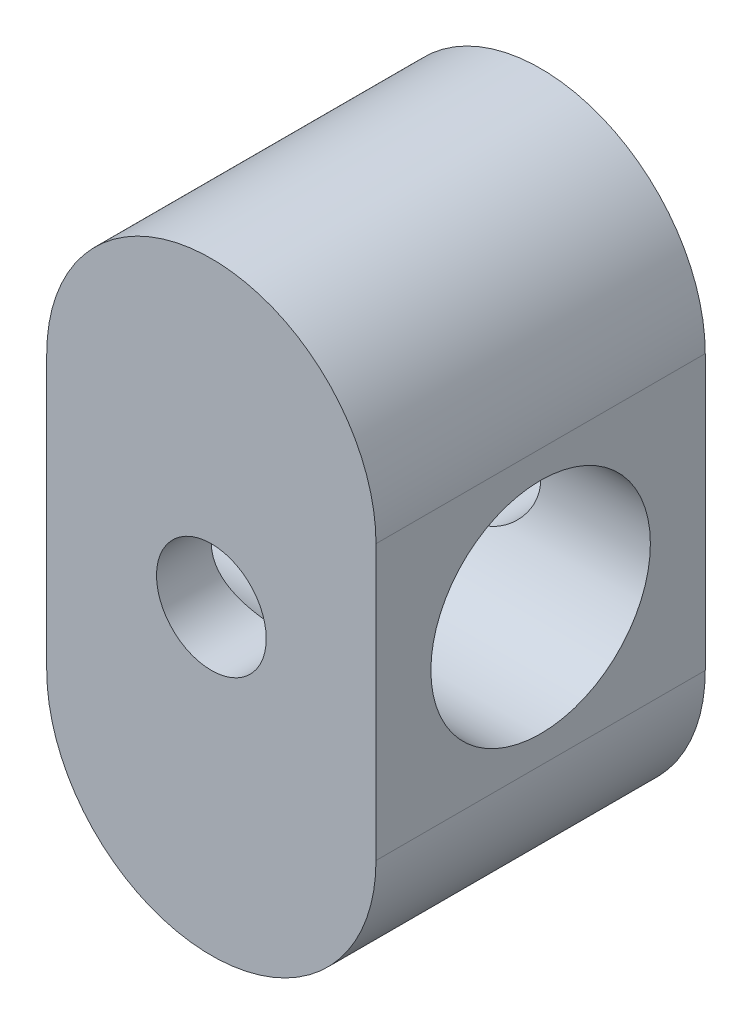
ISO-10303-21;
HEADER;
FILE_DESCRIPTION(('STEP AP214'),'2;1');
FILE_NAME('part.step','',(''),(''),'','','');
FILE_SCHEMA(('AUTOMOTIVE_DESIGN { 1 0 10303 214 1 1 1 1 }'));
ENDSEC;
DATA;
#1=APPLICATION_CONTEXT('core data for automotive mechanical design processes');
#2=APPLICATION_PROTOCOL_DEFINITION('international standard','automotive_design',2000,#1);
#3=PRODUCT_CONTEXT('',#1,'mechanical');
#4=PRODUCT('Part','Part','',(#3));
#5=PRODUCT_RELATED_PRODUCT_CATEGORY('part','',(#4));
#6=PRODUCT_DEFINITION_FORMATION('','',#4);
#7=PRODUCT_DEFINITION_CONTEXT('part definition',#1,'design');
#8=PRODUCT_DEFINITION('design','',#6,#7);
#9=PRODUCT_DEFINITION_SHAPE('','',#8);
#10=(LENGTH_UNIT() NAMED_UNIT(*) SI_UNIT(.MILLI.,.METRE.));
#11=(NAMED_UNIT(*) PLANE_ANGLE_UNIT() SI_UNIT($,.RADIAN.));
#12=(NAMED_UNIT(*) SI_UNIT($,.STERADIAN.) SOLID_ANGLE_UNIT());
#13=UNCERTAINTY_MEASURE_WITH_UNIT(LENGTH_MEASURE(1.E-05),#10,'distance_accuracy_value','');
#14=(GEOMETRIC_REPRESENTATION_CONTEXT(3) GLOBAL_UNCERTAINTY_ASSIGNED_CONTEXT((#13)) GLOBAL_UNIT_ASSIGNED_CONTEXT((#10,
#11,#12)) REPRESENTATION_CONTEXT('',''));
#15=CARTESIAN_POINT('',(0.,0.,0.));
#16=DIRECTION('',(0.,0.,1.));
#17=DIRECTION('',(1.,0.,0.));
#18=AXIS2_PLACEMENT_3D('',#15,#16,#17);
#19=CARTESIAN_POINT('',(0.,0.,38.1));
#20=DIRECTION('',(0.,0.,-1.));
#21=DIRECTION('',(-1.,0.,0.));
#22=AXIS2_PLACEMENT_3D('',#19,#20,#21);
#23=CYLINDRICAL_SURFACE('',#22,6.35);
#24=CARTESIAN_POINT('',(-6.35,0.,31.75));
#25=CARTESIAN_POINT('',(-6.34999944217588,-0.166990879194905,31.7499994891774));
#26=CARTESIAN_POINT('',(-6.34340517119929,-0.333993450198623,31.7466986728259));
#27=CARTESIAN_POINT('',(-6.31710332866815,-0.666768526640036,31.7335786203218));
#28=CARTESIAN_POINT('',(-6.29739005240762,-0.832540465223121,31.7237565484519));
#29=CARTESIAN_POINT('',(-6.24504620131107,-1.16177467728403,31.6978292478083));
#30=CARTESIAN_POINT('',(-6.21239720481971,-1.32523331106834,31.6817150589571));
#31=CARTESIAN_POINT('',(-6.13454367002308,-1.64849348247788,31.6436085062318));
#32=CARTESIAN_POINT('',(-6.0893339997623,-1.80829349634146,31.6216137398496));
#33=CARTESIAN_POINT('',(-5.98706118032938,-2.12244180878877,31.5723959142721));
#34=CARTESIAN_POINT('',(-5.93005033794381,-2.27681076158406,31.5451959650805));
#35=CARTESIAN_POINT('',(-5.80460027805888,-2.57993454237572,31.486150269919));
#36=CARTESIAN_POINT('',(-5.73615677992335,-2.728687241851,31.4543027843762));
#37=CARTESIAN_POINT('',(-5.51459167351378,-3.16512812193645,31.352881193969));
#38=CARTESIAN_POINT('',(-5.34512164103921,-3.44334503957524,31.2773713354024));
#39=CARTESIAN_POINT('',(-4.95605749398617,-3.98471796121714,31.1122186773861));
#40=CARTESIAN_POINT('',(-4.73405124179346,-4.24594454614361,31.0219972312188));
#41=CARTESIAN_POINT('',(-4.25114819119642,-4.72936553155195,30.8393960148839));
#42=CARTESIAN_POINT('',(-3.9902220337443,-4.95153018780438,30.7470146601478));
#43=CARTESIAN_POINT('',(-3.5628248667093,-5.25955398778229,30.6103243398217));
#44=CARTESIAN_POINT('',(-3.40820389376142,-5.3610627049131,30.5634721485475));
#45=CARTESIAN_POINT('',(-3.08994761547517,-5.55058368760464,30.4733099497228));
#46=CARTESIAN_POINT('',(-2.92631610947028,-5.63860158329208,30.4299984680683));
#47=CARTESIAN_POINT('',(-2.59094786440525,-5.800358082891,30.3484098057888));
#48=CARTESIAN_POINT('',(-2.41921165860542,-5.87409762464253,30.3101322945723));
#49=CARTESIAN_POINT('',(-2.06881694320015,-6.00645788836519,30.2400882100936));
#50=CARTESIAN_POINT('',(-1.89016259620782,-6.06508754416237,30.2083177917589));
#51=CARTESIAN_POINT('',(-1.53802379102959,-6.16347180761614,30.154259497995));
#52=CARTESIAN_POINT('',(-1.36486498251088,-6.20414249112447,30.13151961136));
#53=CARTESIAN_POINT('',(-1.0149100900955,-6.27089941680448,30.0938804844397));
#54=CARTESIAN_POINT('',(-0.83811416212465,-6.29698628284913,30.0789809087597));
#55=CARTESIAN_POINT('',(-0.48259070523578,-6.33415533919377,30.0576763086804));
#56=CARTESIAN_POINT('',(-0.303864939404368,-6.34525022098376,30.0512640993806));
#57=CARTESIAN_POINT('',(0.0539765423064514,-6.35229110757549,30.0472004886715));
#58=CARTESIAN_POINT('',(0.233092219351493,-6.34823855771194,30.0495482514047));
#59=CARTESIAN_POINT('',(0.568582301875067,-6.32645177136462,30.062090292946));
#60=CARTESIAN_POINT('',(0.72510735987022,-6.31041699475488,30.0713095833287));
#61=CARTESIAN_POINT('',(1.03609053465783,-6.2668713449148,30.096128374712));
#62=CARTESIAN_POINT('',(1.19054795272157,-6.23935668847137,30.1117299789813));
#63=CARTESIAN_POINT('',(1.49631129670201,-6.17316873448519,30.1488027904553));
#64=CARTESIAN_POINT('',(1.64761763355948,-6.13449690187387,30.170273227066));
#65=CARTESIAN_POINT('',(1.94623864200335,-6.04639785576762,30.2184190383084));
#66=CARTESIAN_POINT('',(2.09355171924189,-5.99696641549927,30.2450964580098));
#67=CARTESIAN_POINT('',(2.53492872693472,-5.83067999912412,30.3331376118079));
#68=CARTESIAN_POINT('',(2.82155056219387,-5.69733157989735,30.401625656313));
#69=CARTESIAN_POINT('',(3.36957685011721,-5.39139880582654,30.550071400071));
#70=CARTESIAN_POINT('',(3.63096990042998,-5.21879682720649,30.6300342452273));
#71=CARTESIAN_POINT('',(4.15618743095877,-4.81373716307424,30.8046812882033));
#72=CARTESIAN_POINT('',(4.41611767035084,-4.57646495884523,30.8999465086129));
#73=CARTESIAN_POINT('',(4.89420340086183,-4.0611227505291,31.0862854764244));
#74=CARTESIAN_POINT('',(5.11233892714115,-3.78303336001455,31.1773572049436));
#75=CARTESIAN_POINT('',(5.40822137451721,-3.33286643739697,31.305938857257));
#76=CARTESIAN_POINT('',(5.50335984672242,-3.17335722609791,31.3483050254296));
#77=CARTESIAN_POINT('',(5.67970671124367,-2.84569771626438,31.4282218301755));
#78=CARTESIAN_POINT('',(5.76092136612927,-2.67755134695862,31.4657746297482));
#79=CARTESIAN_POINT('',(5.90854657110693,-2.33378760343931,31.534957929256));
#80=CARTESIAN_POINT('',(5.97496287286554,-2.15817316355138,31.5665907293456));
#81=CARTESIAN_POINT('',(6.09222165998248,-1.80074808519267,31.6229876360055));
#82=CARTESIAN_POINT('',(6.14306593691524,-1.61893816219401,31.6477525327026));
#83=CARTESIAN_POINT('',(6.22494695974544,-1.26593635485428,31.6878915597613));
#84=CARTESIAN_POINT('',(6.25727558630872,-1.09511243698786,31.7038736459652));
#85=CARTESIAN_POINT('',(6.30784558836316,-0.750891318848436,31.7289562420375));
#86=CARTESIAN_POINT('',(6.32608773009978,-0.577494259066548,31.7380571262137));
#87=CARTESIAN_POINT('',(6.34823872389932,-0.229629611373417,31.7491158370576));
#88=CARTESIAN_POINT('',(6.35215330679286,-0.0551624794535625,31.7510765197081));
#89=CARTESIAN_POINT('',(6.34561139205059,0.293430507417573,31.7478059034872));
#90=CARTESIAN_POINT('',(6.33515553041994,0.467556377130841,31.7425749229034));
#91=CARTESIAN_POINT('',(6.30138636847944,0.800509536744078,31.7257555094506));
#92=CARTESIAN_POINT('',(6.27913692599813,0.959472887164153,31.7146934781011));
#93=CARTESIAN_POINT('',(6.22277883751831,1.2748284005213,31.6868459564446));
#94=CARTESIAN_POINT('',(6.1886661654175,1.43121967166,31.6700585231077));
#95=CARTESIAN_POINT('',(6.10895204704105,1.7403077686404,31.631159973299));
#96=CARTESIAN_POINT('',(6.06335428272778,1.89300576133386,31.6090505630802));
#97=CARTESIAN_POINT('',(5.96108560894157,2.19390570072535,31.5599971792976));
#98=CARTESIAN_POINT('',(5.90441038996764,2.34210587161404,31.5330513245292));
#99=CARTESIAN_POINT('',(5.77873770602808,2.63725856238891,31.4740951779885));
#100=CARTESIAN_POINT('',(5.70943799490311,2.78405822350622,31.4419635638501));
#101=CARTESIAN_POINT('',(5.56021860592232,3.07126756713196,31.37392525103));
#102=CARTESIAN_POINT('',(5.48029532806431,3.21167506178123,31.3380172735192));
#103=CARTESIAN_POINT('',(5.22545088631857,3.62227376445689,31.2257741292216));
#104=CARTESIAN_POINT('',(5.03538892121195,3.8819954012841,31.1448877082824));
#105=CARTESIAN_POINT('',(4.59886015583266,4.39279994151146,30.9694499483036));
#106=CARTESIAN_POINT('',(4.34868719486685,4.64052990372701,30.8743367236915));
#107=CARTESIAN_POINT('',(3.94508991014853,4.9789239543965,30.7339772811164));
#108=CARTESIAN_POINT('',(3.80572389485982,5.08625380253176,30.6875432562751));
#109=CARTESIAN_POINT('',(3.51806625732098,5.28929908879009,30.5966734049483));
#110=CARTESIAN_POINT('',(3.3697733046221,5.38501278922795,30.5522378780468));
#111=CARTESIAN_POINT('',(3.05757189938893,5.56849389071525,30.4645838039713));
#112=CARTESIAN_POINT('',(2.89325455594918,5.65564549590477,30.4215304916549));
#113=CARTESIAN_POINT('',(2.55662946610005,5.81556909376682,30.340579644901));
#114=CARTESIAN_POINT('',(2.38432562101098,5.88834801781484,30.3026796279935));
#115=CARTESIAN_POINT('',(2.03292083584069,6.01870593214496,30.2334979926119));
#116=CARTESIAN_POINT('',(1.85382548494069,6.07629712370975,30.2022110654534));
#117=CARTESIAN_POINT('',(1.49010166197982,6.1755660505623,30.1475495796607));
#118=CARTESIAN_POINT('',(1.30547405141578,6.21724624980147,30.1241737959829));
#119=CARTESIAN_POINT('',(0.950261741474653,6.28083303239845,30.088221566145));
#120=CARTESIAN_POINT('',(0.780030300815074,6.30425367574493,30.0748238589961));
#121=CARTESIAN_POINT('',(0.437794026308638,6.33722186745438,30.0559068618669));
#122=CARTESIAN_POINT('',(0.265789313868249,6.34677035930015,30.0503870360907));
#123=CARTESIAN_POINT('',(-0.0784312834340542,6.3518475564986,30.0474561088362));
#124=CARTESIAN_POINT('',(-0.250647066626202,6.34738144738998,30.0500420081603));
#125=CARTESIAN_POINT('',(-0.5938336660463,6.32451076696088,30.0632073594892));
#126=CARTESIAN_POINT('',(-0.764804532951271,6.30610676625141,30.073786484255));
#127=CARTESIAN_POINT('',(-1.08782968989589,6.25804920718463,30.1011312712702));
#128=CARTESIAN_POINT('',(-1.24012931802116,6.22963986719982,30.1172085028909));
#129=CARTESIAN_POINT('',(-1.54160036066761,6.16196939123337,30.1550268373618));
#130=CARTESIAN_POINT('',(-1.69077071883265,6.12270465222519,30.1767698205995));
#131=CARTESIAN_POINT('',(-2.13222433158772,5.98919755549728,30.2495485940621));
#132=CARTESIAN_POINT('',(-2.41865701909235,5.87921095671373,30.3081531108883));
#133=CARTESIAN_POINT('',(-2.98851600553177,5.61221709335548,30.4437155944897));
#134=CARTESIAN_POINT('',(-3.27044739745236,5.4525471930957,30.5216421113511));
#135=CARTESIAN_POINT('',(-3.80537307337073,5.09367320950779,30.685439817654));
#136=CARTESIAN_POINT('',(-4.05835219423339,4.89444855823949,30.7713151279082));
#137=CARTESIAN_POINT('',(-4.5602382551382,4.43354035272873,30.9538699110716));
#138=CARTESIAN_POINT('',(-4.80491543273466,4.16720894914421,31.0505943076297));
#139=CARTESIAN_POINT('',(-5.13630604997411,3.73813634318359,31.1883310810892));
#140=CARTESIAN_POINT('',(-5.24090509195393,3.59004569732541,31.2330529217553));
#141=CARTESIAN_POINT('',(-5.43745517759955,3.2847358988486,31.3188872478125));
#142=CARTESIAN_POINT('',(-5.52941198125967,3.12752095014408,31.3600013738234));
#143=CARTESIAN_POINT('',(-5.70053310851475,2.80361177397838,31.4378055405892));
#144=CARTESIAN_POINT('',(-5.77959381995961,2.63685404738457,31.4744591999769));
#145=CARTESIAN_POINT('',(-5.9232062854184,2.29614399762542,31.5419115290982));
#146=CARTESIAN_POINT('',(-5.98776516727644,2.12219525894014,31.5727130740716));
#147=CARTESIAN_POINT('',(-6.10151674034033,1.76872534139743,31.6275008101552));
#148=CARTESIAN_POINT('',(-6.15074294600228,1.58921727277206,31.6515018553988));
#149=CARTESIAN_POINT('',(-6.23333526903367,1.22585054083137,31.692019952057));
#150=CARTESIAN_POINT('',(-6.2667110745812,1.04199460738349,31.7085415748002));
#151=CARTESIAN_POINT('',(-6.31123256192435,0.715063028653912,31.7306500718221));
#152=CARTESIAN_POINT('',(-6.32575790184796,0.572548812651066,31.7378936037074));
#153=CARTESIAN_POINT('',(-6.34514199371929,0.286692618188965,31.7475688534566));
#154=CARTESIAN_POINT('',(-6.35000047885508,0.143350616991771,31.7500004385074));
#155=CARTESIAN_POINT('',(-6.35,0.,31.75));
#156=B_SPLINE_CURVE_WITH_KNOTS('',3,(#24,#25,#26,#27,#28,#29,#30,#31,#32,#33,#34,#35,#36,#37,
#38,#39,#40,#41,#42,#43,#44,#45,#46,#47,#48,#49,#50,#51,#52,#53,#54,#55,#56,#57,#58,#59,#60,#61,
#62,#63,#64,#65,#66,#67,#68,#69,#70,#71,#72,#73,#74,#75,#76,#77,#78,#79,#80,#81,#82,#83,#84,#85,
#86,#87,#88,#89,#90,#91,#92,#93,#94,#95,#96,#97,#98,#99,#100,#101,#102,#103,#104,#105,#106,#107,
#108,#109,#110,#111,#112,#113,#114,#115,#116,#117,#118,#119,#120,#121,#122,#123,#124,#125,#126,
#127,#128,#129,#130,#131,#132,#133,#134,#135,#136,#137,#138,#139,#140,#141,#142,#143,#144,#145,
#146,#147,#148,#149,#150,#151,#152,#153,#154,#155),.UNSPECIFIED.,.T.,.F.,(4,2,2,2,2,2,2,2,2,2,2,
2,2,2,2,2,2,2,2,2,2,2,2,2,2,2,2,2,2,2,2,2,2,2,2,2,2,2,2,2,2,2,2,2,2,2,2,2,2,2,2,2,2,2,2,2,2,2,2,
2,2,2,2,2,2,4),(0.,0.50083122420536,1.00188037372803,1.50364564290689,2.0056162222071,
2.50540779268628,3.0053869172507,4.00425210956756,5.06354639773447,6.12364383897773,
6.69546056113472,7.26703799333407,7.83857787007116,8.40977904053159,8.94696617231636,
9.48413032231426,10.020839449589,10.5574973665628,11.0297819407841,11.5022222802449,
11.9746006167424,12.447164856978,13.4133450583963,14.3799599077215,15.4691385823987,
16.558836254714,17.1296896955319,17.7002857039293,18.2706595507726,18.8409677509571,
19.3640345307036,19.8870728558157,20.4099019497636,20.9327079051584,21.4148301207384,
21.8971161172382,22.3792476958438,22.8615672144633,23.3574791185916,23.8535595025871,
24.8452132673351,25.9342484207189,26.4795520760265,27.0249372042286,27.5969396508644,
28.1686655660688,28.7399307681394,29.3111074690516,29.8274552059119,30.3437678229116,
30.8598894217494,31.3759898919437,31.8427315926275,32.3096283963947,33.2427989036526,
34.2386648311406,35.2350499582129,36.3525027406484,36.9121724680045,37.4715863502977,
38.0352942497766,38.5987244700203,39.1609143479984,39.7227601571806,40.1526787482413,
40.5826092051903),.UNSPECIFIED.);
#157=CARTESIAN_POINT('',(-6.35,0.,31.75));
#158=VERTEX_POINT('',#157);
#159=EDGE_CURVE('E36',#158,#158,#156,.T.);
#160=ORIENTED_EDGE('',*,*,#159,.F.);
#161=EDGE_LOOP('',(#160));
#162=FACE_BOUND('',#161,.T.);
#163=CARTESIAN_POINT('',(0.,0.,38.1));
#164=DIRECTION('',(0.,0.,1.));
#165=DIRECTION('',(1.,0.,0.));
#166=AXIS2_PLACEMENT_3D('',#163,#164,#165);
#167=CIRCLE('',#166,6.35);
#168=CARTESIAN_POINT('',(6.35,0.,38.1));
#169=VERTEX_POINT('',#168);
#170=EDGE_CURVE('E139',#169,#169,#167,.T.);
#171=ORIENTED_EDGE('',*,*,#170,.T.);
#172=EDGE_LOOP('',(#171));
#173=FACE_BOUND('',#172,.T.);
#174=ADVANCED_FACE('F32',(#162,#173),#23,.F.);
#175=CARTESIAN_POINT('',(0.,-15.875,0.));
#176=DIRECTION('',(0.,0.,-1.));
#177=DIRECTION('',(-1.,0.,0.));
#178=AXIS2_PLACEMENT_3D('',#175,#176,#177);
#179=CYLINDRICAL_SURFACE('',#178,19.05);
#180=DIRECTION('',(0.,0.,-1.));
#181=VECTOR('',#180,1.);
#182=CARTESIAN_POINT('',(-19.05,-15.875,38.1));
#183=LINE('',#182,#181);
#184=CARTESIAN_POINT('',(-19.05,-15.875,0.));
#185=VERTEX_POINT('',#184);
#186=CARTESIAN_POINT('',(-19.05,-15.875,38.1));
#187=VERTEX_POINT('',#186);
#188=EDGE_CURVE('E107',#185,#187,#183,.F.);
#189=ORIENTED_EDGE('',*,*,#188,.F.);
#190=CARTESIAN_POINT('',(0.,-15.875,0.));
#191=DIRECTION('',(0.,0.,1.));
#192=DIRECTION('',(1.,0.,0.));
#193=AXIS2_PLACEMENT_3D('',#190,#191,#192);
#194=CIRCLE('',#193,19.05);
#195=CARTESIAN_POINT('',(19.05,-15.875,0.));
#196=VERTEX_POINT('',#195);
#197=EDGE_CURVE('E45',#196,#185,#194,.F.);
#198=ORIENTED_EDGE('',*,*,#197,.F.);
#199=DIRECTION('',(0.,0.,-1.));
#200=VECTOR('',#199,1.);
#201=CARTESIAN_POINT('',(19.05,-15.875,38.1));
#202=LINE('',#201,#200);
#203=CARTESIAN_POINT('',(19.05,-15.875,38.1));
#204=VERTEX_POINT('',#203);
#205=EDGE_CURVE('E82',#204,#196,#202,.T.);
#206=ORIENTED_EDGE('',*,*,#205,.F.);
#207=CARTESIAN_POINT('',(0.,-15.875,38.1));
#208=DIRECTION('',(0.,0.,1.));
#209=DIRECTION('',(1.,0.,0.));
#210=AXIS2_PLACEMENT_3D('',#207,#208,#209);
#211=CIRCLE('',#210,19.05);
#212=EDGE_CURVE('E11',#187,#204,#211,.T.);
#213=ORIENTED_EDGE('',*,*,#212,.F.);
#214=EDGE_LOOP('',(#189,#198,#206,#213));
#215=FACE_BOUND('',#214,.T.);
#216=ADVANCED_FACE('F34',(#215),#179,.T.);
#217=CARTESIAN_POINT('',(0.,15.875,0.));
#218=DIRECTION('',(0.,0.,-1.));
#219=DIRECTION('',(-1.,0.,0.));
#220=AXIS2_PLACEMENT_3D('',#217,#218,#219);
#221=CYLINDRICAL_SURFACE('',#220,19.05);
#222=DIRECTION('',(0.,0.,-1.));
#223=VECTOR('',#222,1.);
#224=CARTESIAN_POINT('',(19.05,15.875,38.1));
#225=LINE('',#224,#223);
#226=CARTESIAN_POINT('',(19.05,15.875,0.));
#227=VERTEX_POINT('',#226);
#228=CARTESIAN_POINT('',(19.05,15.875,38.1));
#229=VERTEX_POINT('',#228);
#230=EDGE_CURVE('E81',#227,#229,#225,.F.);
#231=ORIENTED_EDGE('',*,*,#230,.F.);
#232=CARTESIAN_POINT('',(0.,15.875,0.));
#233=DIRECTION('',(0.,0.,1.));
#234=DIRECTION('',(1.,0.,0.));
#235=AXIS2_PLACEMENT_3D('',#232,#233,#234);
#236=CIRCLE('',#235,19.05);
#237=CARTESIAN_POINT('',(-19.05,15.875,0.));
#238=VERTEX_POINT('',#237);
#239=EDGE_CURVE('E88',#238,#227,#236,.F.);
#240=ORIENTED_EDGE('',*,*,#239,.F.);
#241=DIRECTION('',(0.,0.,-1.));
#242=VECTOR('',#241,1.);
#243=CARTESIAN_POINT('',(-19.05,15.875,38.1));
#244=LINE('',#243,#242);
#245=CARTESIAN_POINT('',(-19.05,15.875,38.1));
#246=VERTEX_POINT('',#245);
#247=EDGE_CURVE('E96',#246,#238,#244,.T.);
#248=ORIENTED_EDGE('',*,*,#247,.F.);
#249=CARTESIAN_POINT('',(0.,15.875,38.1));
#250=DIRECTION('',(0.,0.,1.));
#251=DIRECTION('',(1.,0.,0.));
#252=AXIS2_PLACEMENT_3D('',#249,#250,#251);
#253=CIRCLE('',#252,19.05);
#254=EDGE_CURVE('E95',#229,#246,#253,.T.);
#255=ORIENTED_EDGE('',*,*,#254,.F.);
#256=EDGE_LOOP('',(#231,#240,#248,#255));
#257=FACE_BOUND('',#256,.T.);
#258=ADVANCED_FACE('F99',(#257),#221,.T.);
#259=CARTESIAN_POINT('',(-19.05,34.925,38.1));
#260=DIRECTION('',(0.,0.,1.));
#261=DIRECTION('',(1.,0.,0.));
#262=AXIS2_PLACEMENT_3D('',#259,#260,#261);
#263=PLANE('',#262);
#264=DIRECTION('',(0.,-1.,0.));
#265=VECTOR('',#264,1.);
#266=CARTESIAN_POINT('',(-19.05,34.925,38.1));
#267=LINE('',#266,#265);
#268=EDGE_CURVE('E84',#246,#187,#267,.T.);
#269=ORIENTED_EDGE('',*,*,#268,.T.);
#270=ORIENTED_EDGE('',*,*,#212,.T.);
#271=DIRECTION('',(0.,1.,0.));
#272=VECTOR('',#271,1.);
#273=CARTESIAN_POINT('',(19.05,34.925,38.1));
#274=LINE('',#273,#272);
#275=EDGE_CURVE('E100',#204,#229,#274,.T.);
#276=ORIENTED_EDGE('',*,*,#275,.T.);
#277=ORIENTED_EDGE('',*,*,#254,.T.);
#278=EDGE_LOOP('',(#269,#270,#276,#277));
#279=FACE_BOUND('',#278,.T.);
#280=ORIENTED_EDGE('',*,*,#170,.F.);
#281=EDGE_LOOP('',(#280));
#282=FACE_BOUND('',#281,.T.);
#283=ADVANCED_FACE('F150',(#279,#282),#263,.T.);
#284=CARTESIAN_POINT('',(-19.05,34.925,0.));
#285=DIRECTION('',(0.,0.,1.));
#286=DIRECTION('',(1.,0.,0.));
#287=AXIS2_PLACEMENT_3D('',#284,#285,#286);
#288=PLANE('',#287);
#289=DIRECTION('',(0.,1.,0.));
#290=VECTOR('',#289,1.);
#291=CARTESIAN_POINT('',(19.05,34.925,0.));
#292=LINE('',#291,#290);
#293=EDGE_CURVE('E76',#196,#227,#292,.T.);
#294=ORIENTED_EDGE('',*,*,#293,.F.);
#295=ORIENTED_EDGE('',*,*,#197,.T.);
#296=DIRECTION('',(0.,-1.,0.));
#297=VECTOR('',#296,1.);
#298=CARTESIAN_POINT('',(-19.05,34.925,0.));
#299=LINE('',#298,#297);
#300=EDGE_CURVE('E85',#238,#185,#299,.T.);
#301=ORIENTED_EDGE('',*,*,#300,.F.);
#302=ORIENTED_EDGE('',*,*,#239,.T.);
#303=EDGE_LOOP('',(#294,#295,#301,#302));
#304=FACE_BOUND('',#303,.T.);
#305=CARTESIAN_POINT('',(0.,0.,0.));
#306=DIRECTION('',(0.,0.,1.));
#307=DIRECTION('',(1.,0.,0.));
#308=AXIS2_PLACEMENT_3D('',#305,#306,#307);
#309=CIRCLE('',#308,6.35);
#310=CARTESIAN_POINT('',(6.35,0.,0.));
#311=VERTEX_POINT('',#310);
#312=EDGE_CURVE('E141',#311,#311,#309,.T.);
#313=ORIENTED_EDGE('',*,*,#312,.T.);
#314=EDGE_LOOP('',(#313));
#315=FACE_BOUND('',#314,.T.);
#316=ADVANCED_FACE('F89',(#304,#315),#288,.F.);
#317=CARTESIAN_POINT('',(-19.05,34.925,38.1));
#318=DIRECTION('',(1.,0.,0.));
#319=DIRECTION('',(0.,1.,0.));
#320=AXIS2_PLACEMENT_3D('',#317,#318,#319);
#321=PLANE('',#320);
#322=CARTESIAN_POINT('',(-19.05,0.,19.05));
#323=DIRECTION('',(-1.,0.,0.));
#324=DIRECTION('',(0.,-1.,0.));
#325=AXIS2_PLACEMENT_3D('',#322,#323,#324);
#326=CIRCLE('',#325,12.7);
#327=CARTESIAN_POINT('',(-19.05,-12.7,19.05));
#328=VERTEX_POINT('',#327);
#329=EDGE_CURVE('E146',#328,#328,#326,.T.);
#330=ORIENTED_EDGE('',*,*,#329,.F.);
#331=EDGE_LOOP('',(#330));
#332=FACE_BOUND('',#331,.T.);
#333=ORIENTED_EDGE('',*,*,#300,.T.);
#334=ORIENTED_EDGE('',*,*,#188,.T.);
#335=ORIENTED_EDGE('',*,*,#268,.F.);
#336=ORIENTED_EDGE('',*,*,#247,.T.);
#337=EDGE_LOOP('',(#333,#334,#335,#336));
#338=FACE_BOUND('',#337,.T.);
#339=ADVANCED_FACE('F152',(#332,#338),#321,.F.);
#340=CARTESIAN_POINT('',(19.05,34.925,38.1));
#341=DIRECTION('',(-1.,0.,0.));
#342=DIRECTION('',(0.,-1.,0.));
#343=AXIS2_PLACEMENT_3D('',#340,#341,#342);
#344=PLANE('',#343);
#345=CARTESIAN_POINT('',(19.05,0.,19.05));
#346=DIRECTION('',(-1.,0.,0.));
#347=DIRECTION('',(0.,-1.,0.));
#348=AXIS2_PLACEMENT_3D('',#345,#346,#347);
#349=CIRCLE('',#348,12.7);
#350=CARTESIAN_POINT('',(19.05,-12.7,19.05));
#351=VERTEX_POINT('',#350);
#352=EDGE_CURVE('E115',#351,#351,#349,.T.);
#353=ORIENTED_EDGE('',*,*,#352,.T.);
#354=EDGE_LOOP('',(#353));
#355=FACE_BOUND('',#354,.T.);
#356=ORIENTED_EDGE('',*,*,#275,.F.);
#357=ORIENTED_EDGE('',*,*,#205,.T.);
#358=ORIENTED_EDGE('',*,*,#293,.T.);
#359=ORIENTED_EDGE('',*,*,#230,.T.);
#360=EDGE_LOOP('',(#356,#357,#358,#359));
#361=FACE_BOUND('',#360,.T.);
#362=ADVANCED_FACE('F79',(#355,#361),#344,.F.);
#363=CARTESIAN_POINT('',(-6.35,0.,6.35));
#364=CARTESIAN_POINT('',(-6.34999944217588,0.16699087919492,6.35000051082264));
#365=CARTESIAN_POINT('',(-6.34340517119929,0.333993450198638,6.35330132717406));
#366=CARTESIAN_POINT('',(-6.31710332866815,0.666768526640051,6.36642137967822));
#367=CARTESIAN_POINT('',(-6.29739005240762,0.832540465223136,6.37624345154814));
#368=CARTESIAN_POINT('',(-6.24504620131107,1.16177467728404,6.40217075219176));
#369=CARTESIAN_POINT('',(-6.21239720481971,1.32523331106836,6.41828494104293));
#370=CARTESIAN_POINT('',(-6.13454367002308,1.6484934824779,6.45639149376821));
#371=CARTESIAN_POINT('',(-6.0893339997623,1.80829349634148,6.47838626015038));
#372=CARTESIAN_POINT('',(-5.98706118032938,2.12244180878879,6.52760408572793));
#373=CARTESIAN_POINT('',(-5.9300503379438,2.27681076158407,6.55480403491946));
#374=CARTESIAN_POINT('',(-5.80460027805888,2.57993454237573,6.61384973008105));
#375=CARTESIAN_POINT('',(-5.73615677992335,2.72868724185101,6.6456972156238));
#376=CARTESIAN_POINT('',(-5.51459167351377,3.16512812193647,6.74711880603105));
#377=CARTESIAN_POINT('',(-5.34512164103921,3.44334503957525,6.82262866459762));
#378=CARTESIAN_POINT('',(-4.95605749398617,3.98471796121715,6.98778132261394));
#379=CARTESIAN_POINT('',(-4.73405124179346,4.24594454614363,7.07800276878118));
#380=CARTESIAN_POINT('',(-4.25114819119642,4.72936553155197,7.26060398511606));
#381=CARTESIAN_POINT('',(-3.9902220337443,4.9515301878044,7.35298533985225));
#382=CARTESIAN_POINT('',(-3.5628248667093,5.2595539877823,7.48967566017826));
#383=CARTESIAN_POINT('',(-3.40820389376141,5.36106270491311,7.53652785145253));
#384=CARTESIAN_POINT('',(-3.08994761547517,5.55058368760466,7.62669005027722));
#385=CARTESIAN_POINT('',(-2.92631610947028,5.6386015832921,7.67000153193174));
#386=CARTESIAN_POINT('',(-2.59094786440525,5.80035808289101,7.75159019421125));
#387=CARTESIAN_POINT('',(-2.41921165860542,5.87409762464254,7.78986770542772));
#388=CARTESIAN_POINT('',(-2.06881694320015,6.0064578883652,7.85991178990636));
#389=CARTESIAN_POINT('',(-1.89016259620782,6.06508754416239,7.89168220824115));
#390=CARTESIAN_POINT('',(-1.53802379102958,6.16347180761615,7.94574050200502));
#391=CARTESIAN_POINT('',(-1.36486498251087,6.20414249112449,7.96848038863999));
#392=CARTESIAN_POINT('',(-1.0149100900955,6.27089941680449,8.00611951556031));
#393=CARTESIAN_POINT('',(-0.838114162124646,6.29698628284914,8.02101909124034));
#394=CARTESIAN_POINT('',(-0.482590705235776,6.33415533919378,8.04232369131965));
#395=CARTESIAN_POINT('',(-0.303864939404362,6.34525022098378,8.04873590061936));
#396=CARTESIAN_POINT('',(0.0539765423064575,6.3522911075755,8.05279951132849));
#397=CARTESIAN_POINT('',(0.233092219351499,6.34823855771195,8.05045174859527));
#398=CARTESIAN_POINT('',(0.568582301875072,6.32645177136463,8.03790970705401));
#399=CARTESIAN_POINT('',(0.725107359870225,6.3104169947549,8.02869041667128));
#400=CARTESIAN_POINT('',(1.03609053465784,6.26687134491481,8.00387162528804));
#401=CARTESIAN_POINT('',(1.19054795272157,6.23935668847138,7.98827002101874));
#402=CARTESIAN_POINT('',(1.49631129670202,6.1731687344852,7.95119720954467));
#403=CARTESIAN_POINT('',(1.64761763355949,6.13449690187389,7.92972677293399));
#404=CARTESIAN_POINT('',(1.94623864200335,6.04639785576763,7.88158096169158));
#405=CARTESIAN_POINT('',(2.09355171924189,5.99696641549928,7.85490354199017));
#406=CARTESIAN_POINT('',(2.53492872693472,5.83067999912414,7.76686238819207));
#407=CARTESIAN_POINT('',(2.82155056219387,5.69733157989736,7.69837434368704));
#408=CARTESIAN_POINT('',(3.36957685011721,5.39139880582655,7.54992859992901));
#409=CARTESIAN_POINT('',(3.63096990042998,5.2187968272065,7.46996575477275));
#410=CARTESIAN_POINT('',(4.15618743095877,4.81373716307425,7.29531871179675));
#411=CARTESIAN_POINT('',(4.41611767035084,4.57646495884524,7.20005349138713));
#412=CARTESIAN_POINT('',(4.89420340086183,4.06112275052911,7.01371452357558));
#413=CARTESIAN_POINT('',(5.11233892714115,3.78303336001457,6.92264279505645));
#414=CARTESIAN_POINT('',(5.40822137451721,3.33286643739698,6.79406114274297));
#415=CARTESIAN_POINT('',(5.50335984672241,3.17335722609793,6.75169497457043));
#416=CARTESIAN_POINT('',(5.67970671124367,2.8456977162644,6.67177816982451));
#417=CARTESIAN_POINT('',(5.76092136612927,2.67755134695863,6.63422537025183));
#418=CARTESIAN_POINT('',(5.90854657110693,2.33378760343932,6.56504207074406));
#419=CARTESIAN_POINT('',(5.97496287286554,2.1581731635514,6.53340927065436));
#420=CARTESIAN_POINT('',(6.09222165998248,1.80074808519268,6.47701236399453));
#421=CARTESIAN_POINT('',(6.14306593691524,1.61893816219403,6.45224746729739));
#422=CARTESIAN_POINT('',(6.22494695974544,1.2659363548543,6.41210844023867));
#423=CARTESIAN_POINT('',(6.25727558630872,1.09511243698787,6.3961263540348));
#424=CARTESIAN_POINT('',(6.30784558836317,0.750891318848447,6.37104375796255));
#425=CARTESIAN_POINT('',(6.32608773009978,0.577494259066559,6.36194287378632));
#426=CARTESIAN_POINT('',(6.34823872389932,0.229629611373427,6.35088416294244));
#427=CARTESIAN_POINT('',(6.35215330679286,0.0551624794535718,6.3489234802919));
#428=CARTESIAN_POINT('',(6.34561139205059,-0.293430507417563,6.35219409651281));
#429=CARTESIAN_POINT('',(6.33515553041994,-0.46755637713083,6.35742507709662));
#430=CARTESIAN_POINT('',(6.30138636847944,-0.800509536744065,6.37424449054937));
#431=CARTESIAN_POINT('',(6.27913692599813,-0.95947288716414,6.3853065218989));
#432=CARTESIAN_POINT('',(6.22277883751831,-1.27482840052129,6.41315404355538));
#433=CARTESIAN_POINT('',(6.1886661654175,-1.43121967165998,6.42994147689229));
#434=CARTESIAN_POINT('',(6.10895204704105,-1.74030776864038,6.46884002670103));
#435=CARTESIAN_POINT('',(6.06335428272778,-1.89300576133385,6.49094943691985));
#436=CARTESIAN_POINT('',(5.96108560894157,-2.19390570072534,6.54000282070244));
#437=CARTESIAN_POINT('',(5.90441038996764,-2.34210587161403,6.56694867547082));
#438=CARTESIAN_POINT('',(5.77873770602808,-2.6372585623889,6.62590482201149));
#439=CARTESIAN_POINT('',(5.70943799490311,-2.78405822350621,6.65803643614986));
#440=CARTESIAN_POINT('',(5.56021860592231,-3.07126756713195,6.72607474896997));
#441=CARTESIAN_POINT('',(5.48029532806431,-3.21167506178122,6.76198272648078));
#442=CARTESIAN_POINT('',(5.22545088631857,-3.62227376445688,6.87422587077843));
#443=CARTESIAN_POINT('',(5.03538892121195,-3.88199540128409,6.95511229171762));
#444=CARTESIAN_POINT('',(4.59886015583266,-4.39279994151145,7.13055005169643));
#445=CARTESIAN_POINT('',(4.34868719486684,-4.640529903727,7.22566327630849));
#446=CARTESIAN_POINT('',(3.94508991014853,-4.97892395439649,7.36602271888358));
#447=CARTESIAN_POINT('',(3.80572389485982,-5.08625380253175,7.41245674372491));
#448=CARTESIAN_POINT('',(3.51806625732098,-5.28929908879008,7.50332659505171));
#449=CARTESIAN_POINT('',(3.36977330462209,-5.38501278922794,7.54776212195323));
#450=CARTESIAN_POINT('',(3.05757189938893,-5.56849389071524,7.63541619602874));
#451=CARTESIAN_POINT('',(2.89325455594918,-5.65564549590476,7.67846950834513));
#452=CARTESIAN_POINT('',(2.55662946610005,-5.81556909376681,7.75942035509898));
#453=CARTESIAN_POINT('',(2.38432562101098,-5.88834801781483,7.7973203720065));
#454=CARTESIAN_POINT('',(2.03292083584069,-6.01870593214495,7.86650200738805));
#455=CARTESIAN_POINT('',(1.85382548494069,-6.07629712370974,7.89778893454655));
#456=CARTESIAN_POINT('',(1.49010166197982,-6.17556605056229,7.95245042033926));
#457=CARTESIAN_POINT('',(1.30547405141578,-6.21724624980145,7.97582620401713));
#458=CARTESIAN_POINT('',(0.950261741474646,-6.28083303239843,8.01177843385501));
#459=CARTESIAN_POINT('',(0.780030300815066,-6.30425367574492,8.02517614100386));
#460=CARTESIAN_POINT('',(0.43779402630863,-6.33722186745437,8.04409313813313));
#461=CARTESIAN_POINT('',(0.265789313868241,-6.34677035930014,8.04961296390926));
#462=CARTESIAN_POINT('',(-0.0784312834340605,-6.35184755649859,8.05254389116378));
#463=CARTESIAN_POINT('',(-0.250647066626209,-6.34738144738996,8.04995799183969));
#464=CARTESIAN_POINT('',(-0.593833666046306,-6.32451076696087,8.03679264051078));
#465=CARTESIAN_POINT('',(-0.764804532951276,-6.3061067662514,8.02621351574503));
#466=CARTESIAN_POINT('',(-1.08782968989589,-6.25804920718461,7.9988687287298));
#467=CARTESIAN_POINT('',(-1.24012931802116,-6.2296398671998,7.98279149710908));
#468=CARTESIAN_POINT('',(-1.54160036066761,-6.16196939123335,7.94497316263816));
#469=CARTESIAN_POINT('',(-1.69077071883265,-6.12270465222517,7.9232301794005));
#470=CARTESIAN_POINT('',(-2.13222433158773,-5.98919755549726,7.85045140593787));
#471=CARTESIAN_POINT('',(-2.41865701909235,-5.87921095671372,7.79184688911172));
#472=CARTESIAN_POINT('',(-2.98851600553177,-5.61221709335546,7.65628440551034));
#473=CARTESIAN_POINT('',(-3.27044739745236,-5.45254719309569,7.57835788864889));
#474=CARTESIAN_POINT('',(-3.80537307337073,-5.09367320950778,7.41456018234597));
#475=CARTESIAN_POINT('',(-4.05835219423339,-4.89444855823947,7.32868487209177));
#476=CARTESIAN_POINT('',(-4.5602382551382,-4.43354035272871,7.14613008892837));
#477=CARTESIAN_POINT('',(-4.80491543273467,-4.1672089491442,7.04940569237028));
#478=CARTESIAN_POINT('',(-5.13630604997411,-3.73813634318358,6.91166891891078));
#479=CARTESIAN_POINT('',(-5.24090509195393,-3.5900456973254,6.86694707824464));
#480=CARTESIAN_POINT('',(-5.43745517759956,-3.28473589884858,6.78111275218748));
#481=CARTESIAN_POINT('',(-5.52941198125967,-3.12752095014407,6.73999862617664));
#482=CARTESIAN_POINT('',(-5.70053310851475,-2.80361177397836,6.66219445941081));
#483=CARTESIAN_POINT('',(-5.77959381995961,-2.63685404738455,6.62554080002309));
#484=CARTESIAN_POINT('',(-5.9232062854184,-2.2961439976254,6.55808847090184));
#485=CARTESIAN_POINT('',(-5.98776516727644,-2.12219525894012,6.52728692592841));
#486=CARTESIAN_POINT('',(-6.10151674034033,-1.7687253413974,6.47249918984481));
#487=CARTESIAN_POINT('',(-6.15074294600228,-1.58921727277204,6.4484981446012));
#488=CARTESIAN_POINT('',(-6.23333526903367,-1.22585054083135,6.40798004794303));
#489=CARTESIAN_POINT('',(-6.2667110745812,-1.04199460738347,6.39145842519978));
#490=CARTESIAN_POINT('',(-6.31123256192435,-0.715063028653899,6.36934992817795));
#491=CARTESIAN_POINT('',(-6.32575790184796,-0.572548812651056,6.36210639629264));
#492=CARTESIAN_POINT('',(-6.34514199371929,-0.286692618188956,6.35243114654341));
#493=CARTESIAN_POINT('',(-6.35000047885508,-0.143350616991759,6.34999956149258));
#494=CARTESIAN_POINT('',(-6.35,0.,6.35));
#495=B_SPLINE_CURVE_WITH_KNOTS('',3,(#363,#364,#365,#366,#367,#368,#369,#370,#371,#372,#373,
#374,#375,#376,#377,#378,#379,#380,#381,#382,#383,#384,#385,#386,#387,#388,#389,#390,#391,#392,
#393,#394,#395,#396,#397,#398,#399,#400,#401,#402,#403,#404,#405,#406,#407,#408,#409,#410,#411,
#412,#413,#414,#415,#416,#417,#418,#419,#420,#421,#422,#423,#424,#425,#426,#427,#428,#429,#430,
#431,#432,#433,#434,#435,#436,#437,#438,#439,#440,#441,#442,#443,#444,#445,#446,#447,#448,#449,
#450,#451,#452,#453,#454,#455,#456,#457,#458,#459,#460,#461,#462,#463,#464,#465,#466,#467,#468,
#469,#470,#471,#472,#473,#474,#475,#476,#477,#478,#479,#480,#481,#482,#483,#484,#485,#486,#487,
#488,#489,#490,#491,#492,#493,#494),.UNSPECIFIED.,.T.,.F.,(4,2,2,2,2,2,2,2,2,2,2,2,2,2,2,2,2,2,
2,2,2,2,2,2,2,2,2,2,2,2,2,2,2,2,2,2,2,2,2,2,2,2,2,2,2,2,2,2,2,2,2,2,2,2,2,2,2,2,2,2,2,2,2,2,2,
4),(0.,0.50083122420536,1.00188037372803,1.50364564290689,2.0056162222071,2.50540779268628,
3.0053869172507,4.00425210956756,5.06354639773447,6.12364383897773,6.69546056113473,
7.26703799333408,7.83857787007117,8.4097790405316,8.94696617231636,9.48413032231427,
10.020839449589,10.5574973665628,11.0297819407841,11.5022222802449,11.9746006167424,
12.447164856978,13.4133450583963,14.3799599077215,15.4691385823987,16.558836254714,
17.1296896955319,17.7002857039293,18.2706595507726,18.8409677509571,19.3640345307036,
19.8870728558157,20.4099019497636,20.9327079051584,21.4148301207384,21.8971161172382,
22.3792476958438,22.8615672144633,23.3574791185916,23.8535595025871,24.8452132673351,
25.9342484207189,26.4795520760265,27.0249372042286,27.5969396508644,28.1686655660688,
28.7399307681394,29.3111074690516,29.8274552059119,30.3437678229116,30.8598894217494,
31.3759898919437,31.8427315926275,32.3096283963947,33.2427989036526,34.2386648311406,
35.2350499582129,36.3525027406484,36.9121724680045,37.4715863502977,38.0352942497766,
38.5987244700203,39.1609143479984,39.7227601571806,40.1526787482413,40.5826092051903),.UNSPECIFIED.);
#496=CARTESIAN_POINT('',(-6.35,0.,6.35));
#497=VERTEX_POINT('',#496);
#498=EDGE_CURVE('E111',#497,#497,#495,.T.);
#499=ORIENTED_EDGE('',*,*,#498,.F.);
#500=EDGE_LOOP('',(#499));
#501=FACE_BOUND('',#500,.T.);
#502=ORIENTED_EDGE('',*,*,#312,.F.);
#503=EDGE_LOOP('',(#502));
#504=FACE_BOUND('',#503,.T.);
#505=ADVANCED_FACE('F116',(#501,#504),#23,.F.);
#506=CARTESIAN_POINT('',(19.05,0.,19.05));
#507=DIRECTION('',(-1.,0.,0.));
#508=DIRECTION('',(0.,-1.,0.));
#509=AXIS2_PLACEMENT_3D('',#506,#507,#508);
#510=CYLINDRICAL_SURFACE('',#509,12.7);
#511=ORIENTED_EDGE('',*,*,#159,.T.);
#512=EDGE_LOOP('',(#511));
#513=FACE_BOUND('',#512,.T.);
#514=ORIENTED_EDGE('',*,*,#498,.T.);
#515=EDGE_LOOP('',(#514));
#516=FACE_BOUND('',#515,.T.);
#517=ORIENTED_EDGE('',*,*,#352,.F.);
#518=EDGE_LOOP('',(#517));
#519=FACE_BOUND('',#518,.T.);
#520=ORIENTED_EDGE('',*,*,#329,.T.);
#521=EDGE_LOOP('',(#520));
#522=FACE_BOUND('',#521,.T.);
#523=ADVANCED_FACE('F119',(#513,#516,#519,#522),#510,.F.);
#524=CLOSED_SHELL('',(#174,#216,#258,#283,#316,#339,#362,#505,#523));
#525=MANIFOLD_SOLID_BREP('B2',#524);
#526=ADVANCED_BREP_SHAPE_REPRESENTATION('',(#18,#525),#14);
#527=SHAPE_DEFINITION_REPRESENTATION(#9,#526);
ENDSEC;
END-ISO-10303-21;
